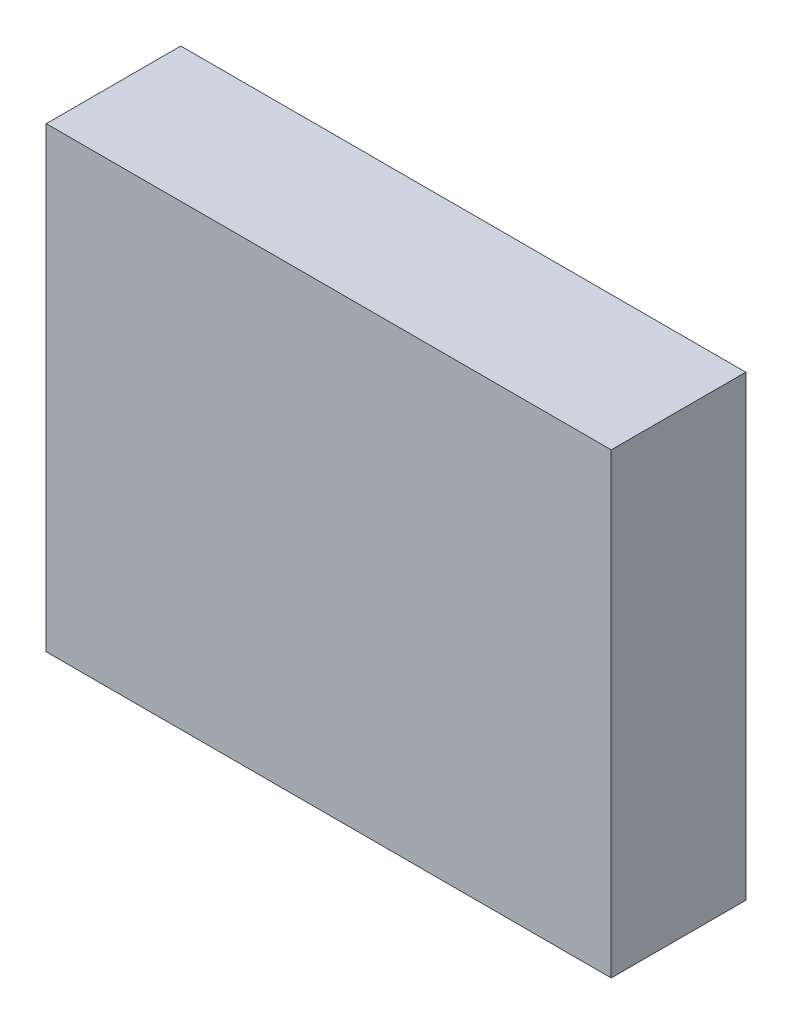
ISO-10303-21;
HEADER;
FILE_DESCRIPTION(('STEP AP214'),'2;1');
FILE_NAME('part.step','',(''),(''),'','','');
FILE_SCHEMA(('AUTOMOTIVE_DESIGN { 1 0 10303 214 1 1 1 1 }'));
ENDSEC;
DATA;
#1=APPLICATION_CONTEXT('core data for automotive mechanical design processes');
#2=APPLICATION_PROTOCOL_DEFINITION('international standard','automotive_design',2000,#1);
#3=PRODUCT_CONTEXT('',#1,'mechanical');
#4=PRODUCT('Part','Part','',(#3));
#5=PRODUCT_RELATED_PRODUCT_CATEGORY('part','',(#4));
#6=PRODUCT_DEFINITION_FORMATION('','',#4);
#7=PRODUCT_DEFINITION_CONTEXT('part definition',#1,'design');
#8=PRODUCT_DEFINITION('design','',#6,#7);
#9=PRODUCT_DEFINITION_SHAPE('','',#8);
#10=(LENGTH_UNIT() NAMED_UNIT(*) SI_UNIT(.MILLI.,.METRE.));
#11=(NAMED_UNIT(*) PLANE_ANGLE_UNIT() SI_UNIT($,.RADIAN.));
#12=(NAMED_UNIT(*) SI_UNIT($,.STERADIAN.) SOLID_ANGLE_UNIT());
#13=UNCERTAINTY_MEASURE_WITH_UNIT(LENGTH_MEASURE(1.E-05),#10,'distance_accuracy_value','');
#14=(GEOMETRIC_REPRESENTATION_CONTEXT(3) GLOBAL_UNCERTAINTY_ASSIGNED_CONTEXT((#13)) GLOBAL_UNIT_ASSIGNED_CONTEXT((#10,
#11,#12)) REPRESENTATION_CONTEXT('',''));
#15=CARTESIAN_POINT('',(0.,0.,0.));
#16=DIRECTION('',(0.,0.,1.));
#17=DIRECTION('',(1.,0.,0.));
#18=AXIS2_PLACEMENT_3D('',#15,#16,#17);
#19=CARTESIAN_POINT('',(-1.05000298,-0.85000084,0.499999));
#20=DIRECTION('',(0.,0.,1.));
#21=DIRECTION('',(1.,0.,0.));
#22=AXIS2_PLACEMENT_3D('',#19,#20,#21);
#23=PLANE('',#22);
#24=DIRECTION('',(-0.999999999999268,-1.20952182476632E-06,0.));
#25=VECTOR('',#24,1.);
#26=CARTESIAN_POINT('',(1.05000044,-0.8499983,0.499999));
#27=LINE('',#26,#25);
#28=CARTESIAN_POINT('',(1.05000044,-0.8499983,0.499999));
#29=VERTEX_POINT('',#28);
#30=CARTESIAN_POINT('',(-1.05000298,-0.85000084,0.499999));
#31=VERTEX_POINT('',#30);
#32=EDGE_CURVE('E20',#29,#31,#27,.T.);
#33=ORIENTED_EDGE('',*,*,#32,.F.);
#34=DIRECTION('',(-1.49411615203383E-06,-0.999999999998884,0.));
#35=VECTOR('',#34,1.);
#36=CARTESIAN_POINT('',(1.05000298,0.85000338,0.499999));
#37=LINE('',#36,#35);
#38=CARTESIAN_POINT('',(1.05000298,0.85000338,0.499999));
#39=VERTEX_POINT('',#38);
#40=EDGE_CURVE('E74',#39,#29,#37,.T.);
#41=ORIENTED_EDGE('',*,*,#40,.F.);
#42=DIRECTION('',(0.999999999999268,1.20952182476632E-06,0.));
#43=VECTOR('',#42,1.);
#44=CARTESIAN_POINT('',(-1.05000044,0.85000084,0.499999));
#45=LINE('',#44,#43);
#46=CARTESIAN_POINT('',(-1.05000044,0.85000084,0.499999));
#47=VERTEX_POINT('',#46);
#48=EDGE_CURVE('E68',#47,#39,#45,.T.);
#49=ORIENTED_EDGE('',*,*,#48,.F.);
#50=DIRECTION('',(1.49411615203383E-06,0.999999999998884,0.));
#51=VECTOR('',#50,1.);
#52=CARTESIAN_POINT('',(-1.05000298,-0.85000084,0.499999));
#53=LINE('',#52,#51);
#54=EDGE_CURVE('E71',#31,#47,#53,.T.);
#55=ORIENTED_EDGE('',*,*,#54,.F.);
#56=EDGE_LOOP('',(#33,#41,#49,#55));
#57=FACE_BOUND('',#56,.T.);
#58=ADVANCED_FACE('F17',(#57),#23,.T.);
#59=CARTESIAN_POINT('',(-1.05000298,-0.85000084,0.));
#60=DIRECTION('',(0.,0.,1.));
#61=DIRECTION('',(1.,0.,0.));
#62=AXIS2_PLACEMENT_3D('',#59,#60,#61);
#63=PLANE('',#62);
#64=DIRECTION('',(1.49411615203383E-06,0.999999999998884,0.));
#65=VECTOR('',#64,1.);
#66=CARTESIAN_POINT('',(-1.05000298,-0.85000084,0.));
#67=LINE('',#66,#65);
#68=CARTESIAN_POINT('',(-1.05000298,-0.85000084,0.));
#69=VERTEX_POINT('',#68);
#70=CARTESIAN_POINT('',(-1.05000044,0.85000084,0.));
#71=VERTEX_POINT('',#70);
#72=EDGE_CURVE('E80',#69,#71,#67,.T.);
#73=ORIENTED_EDGE('',*,*,#72,.T.);
#74=DIRECTION('',(0.999999999999268,1.20952182476632E-06,0.));
#75=VECTOR('',#74,1.);
#76=CARTESIAN_POINT('',(-1.05000044,0.85000084,0.));
#77=LINE('',#76,#75);
#78=CARTESIAN_POINT('',(1.05000298,0.85000338,0.));
#79=VERTEX_POINT('',#78);
#80=EDGE_CURVE('E86',#71,#79,#77,.T.);
#81=ORIENTED_EDGE('',*,*,#80,.T.);
#82=DIRECTION('',(-1.49411615203383E-06,-0.999999999998884,0.));
#83=VECTOR('',#82,1.);
#84=CARTESIAN_POINT('',(1.05000298,0.85000338,0.));
#85=LINE('',#84,#83);
#86=CARTESIAN_POINT('',(1.05000044,-0.8499983,0.));
#87=VERTEX_POINT('',#86);
#88=EDGE_CURVE('E107',#79,#87,#85,.T.);
#89=ORIENTED_EDGE('',*,*,#88,.T.);
#90=DIRECTION('',(-0.999999999999268,-1.20952182476632E-06,0.));
#91=VECTOR('',#90,1.);
#92=CARTESIAN_POINT('',(1.05000044,-0.8499983,0.));
#93=LINE('',#92,#91);
#94=EDGE_CURVE('E11',#87,#69,#93,.T.);
#95=ORIENTED_EDGE('',*,*,#94,.T.);
#96=EDGE_LOOP('',(#73,#81,#89,#95));
#97=FACE_BOUND('',#96,.T.);
#98=ADVANCED_FACE('F123',(#97),#63,.F.);
#99=CARTESIAN_POINT('',(1.05000044,-0.8499983,0.));
#100=DIRECTION('',(1.20952182476632E-06,-0.999999999999268,0.));
#101=DIRECTION('',(0.,0.,-1.));
#102=AXIS2_PLACEMENT_3D('',#99,#100,#101);
#103=PLANE('',#102);
#104=DIRECTION('',(0.,0.,1.));
#105=VECTOR('',#104,1.);
#106=CARTESIAN_POINT('',(1.05000044,-0.8499983,0.));
#107=LINE('',#106,#105);
#108=EDGE_CURVE('E105',#87,#29,#107,.T.);
#109=ORIENTED_EDGE('',*,*,#108,.T.);
#110=ORIENTED_EDGE('',*,*,#32,.T.);
#111=DIRECTION('',(0.,0.,1.));
#112=VECTOR('',#111,1.);
#113=CARTESIAN_POINT('',(-1.05000298,-0.85000084,0.));
#114=LINE('',#113,#112);
#115=EDGE_CURVE('E93',#69,#31,#114,.T.);
#116=ORIENTED_EDGE('',*,*,#115,.F.);
#117=ORIENTED_EDGE('',*,*,#94,.F.);
#118=EDGE_LOOP('',(#109,#110,#116,#117));
#119=FACE_BOUND('',#118,.T.);
#120=ADVANCED_FACE('F120',(#119),#103,.T.);
#121=CARTESIAN_POINT('',(1.05000298,0.85000338,0.));
#122=DIRECTION('',(0.999999999998884,-1.49411615203383E-06,0.));
#123=DIRECTION('',(0.,0.,-1.));
#124=AXIS2_PLACEMENT_3D('',#121,#122,#123);
#125=PLANE('',#124);
#126=DIRECTION('',(0.,0.,1.));
#127=VECTOR('',#126,1.);
#128=CARTESIAN_POINT('',(1.05000298,0.85000338,0.));
#129=LINE('',#128,#127);
#130=EDGE_CURVE('E79',#79,#39,#129,.T.);
#131=ORIENTED_EDGE('',*,*,#130,.T.);
#132=ORIENTED_EDGE('',*,*,#40,.T.);
#133=ORIENTED_EDGE('',*,*,#108,.F.);
#134=ORIENTED_EDGE('',*,*,#88,.F.);
#135=EDGE_LOOP('',(#131,#132,#133,#134));
#136=FACE_BOUND('',#135,.T.);
#137=ADVANCED_FACE('F122',(#136),#125,.T.);
#138=CARTESIAN_POINT('',(-1.05000044,0.85000084,0.));
#139=DIRECTION('',(-1.20952182476632E-06,0.999999999999268,0.));
#140=DIRECTION('',(0.,0.,1.));
#141=AXIS2_PLACEMENT_3D('',#138,#139,#140);
#142=PLANE('',#141);
#143=DIRECTION('',(0.,0.,1.));
#144=VECTOR('',#143,1.);
#145=CARTESIAN_POINT('',(-1.05000044,0.85000084,0.));
#146=LINE('',#145,#144);
#147=EDGE_CURVE('E83',#71,#47,#146,.T.);
#148=ORIENTED_EDGE('',*,*,#147,.T.);
#149=ORIENTED_EDGE('',*,*,#48,.T.);
#150=ORIENTED_EDGE('',*,*,#130,.F.);
#151=ORIENTED_EDGE('',*,*,#80,.F.);
#152=EDGE_LOOP('',(#148,#149,#150,#151));
#153=FACE_BOUND('',#152,.T.);
#154=ADVANCED_FACE('F84',(#153),#142,.T.);
#155=CARTESIAN_POINT('',(-1.05000298,-0.85000084,0.));
#156=DIRECTION('',(-0.999999999998884,1.49411615203383E-06,0.));
#157=DIRECTION('',(0.,0.,1.));
#158=AXIS2_PLACEMENT_3D('',#155,#156,#157);
#159=PLANE('',#158);
#160=ORIENTED_EDGE('',*,*,#115,.T.);
#161=ORIENTED_EDGE('',*,*,#54,.T.);
#162=ORIENTED_EDGE('',*,*,#147,.F.);
#163=ORIENTED_EDGE('',*,*,#72,.F.);
#164=EDGE_LOOP('',(#160,#161,#162,#163));
#165=FACE_BOUND('',#164,.T.);
#166=ADVANCED_FACE('F92',(#165),#159,.T.);
#167=CLOSED_SHELL('',(#58,#98,#120,#137,#154,#166));
#168=MANIFOLD_SOLID_BREP('B1',#167);
#169=ADVANCED_BREP_SHAPE_REPRESENTATION('',(#18,#168),#14);
#170=SHAPE_DEFINITION_REPRESENTATION(#9,#169);
ENDSEC;
END-ISO-10303-21;
